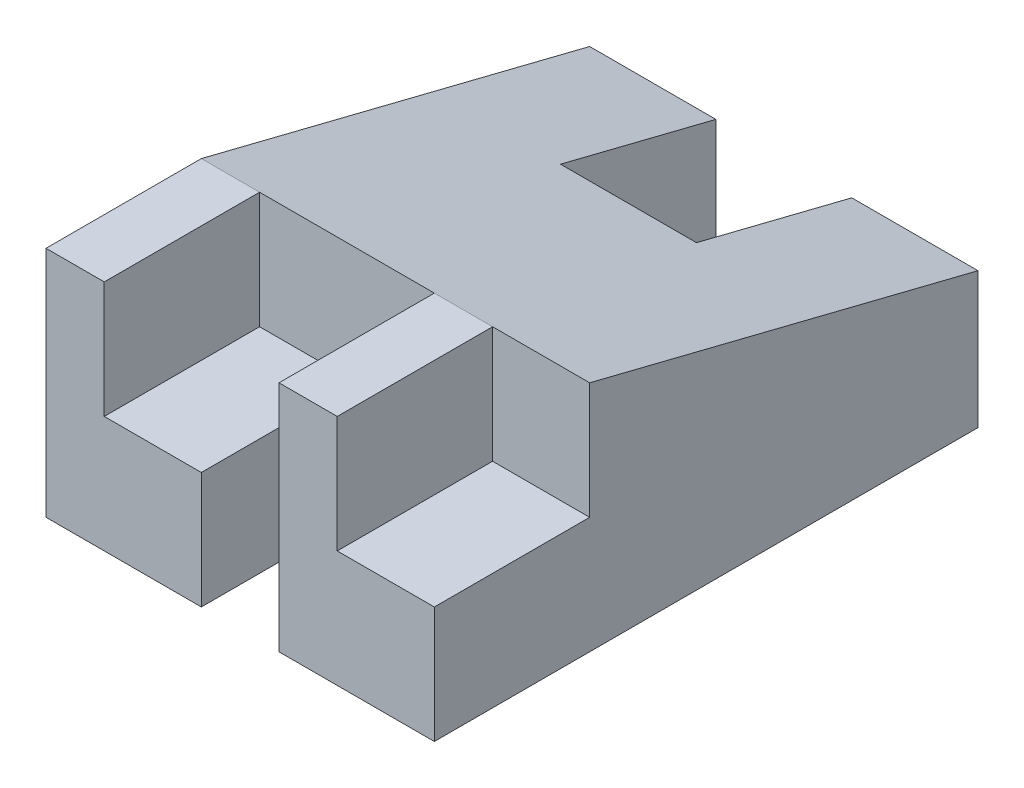
ISO-10303-21;
HEADER;
FILE_DESCRIPTION(('STEP AP214'),'2;1');
FILE_NAME('part.step','',(''),(''),'','','');
FILE_SCHEMA(('AUTOMOTIVE_DESIGN { 1 0 10303 214 1 1 1 1 }'));
ENDSEC;
DATA;
#1=APPLICATION_CONTEXT('core data for automotive mechanical design processes');
#2=APPLICATION_PROTOCOL_DEFINITION('international standard','automotive_design',2000,#1);
#3=PRODUCT_CONTEXT('',#1,'mechanical');
#4=PRODUCT('Part','Part','',(#3));
#5=PRODUCT_RELATED_PRODUCT_CATEGORY('part','',(#4));
#6=PRODUCT_DEFINITION_FORMATION('','',#4);
#7=PRODUCT_DEFINITION_CONTEXT('part definition',#1,'design');
#8=PRODUCT_DEFINITION('design','',#6,#7);
#9=PRODUCT_DEFINITION_SHAPE('','',#8);
#10=(LENGTH_UNIT() NAMED_UNIT(*) SI_UNIT(.MILLI.,.METRE.));
#11=(NAMED_UNIT(*) PLANE_ANGLE_UNIT() SI_UNIT($,.RADIAN.));
#12=(NAMED_UNIT(*) SI_UNIT($,.STERADIAN.) SOLID_ANGLE_UNIT());
#13=UNCERTAINTY_MEASURE_WITH_UNIT(LENGTH_MEASURE(1.E-05),#10,'distance_accuracy_value','');
#14=(GEOMETRIC_REPRESENTATION_CONTEXT(3) GLOBAL_UNCERTAINTY_ASSIGNED_CONTEXT((#13)) GLOBAL_UNIT_ASSIGNED_CONTEXT((#10,
#11,#12)) REPRESENTATION_CONTEXT('',''));
#15=CARTESIAN_POINT('',(0.,0.,0.));
#16=DIRECTION('',(0.,0.,1.));
#17=DIRECTION('',(1.,0.,0.));
#18=AXIS2_PLACEMENT_3D('',#15,#16,#17);
#19=CARTESIAN_POINT('',(31.75,-26.4278044871795,-36.8991987179487));
#20=DIRECTION('',(0.,0.,1.));
#21=DIRECTION('',(1.,0.,0.));
#22=AXIS2_PLACEMENT_3D('',#19,#20,#21);
#23=PLANE('',#22);
#24=DIRECTION('',(-1.,0.,0.));
#25=VECTOR('',#24,1.);
#26=CARTESIAN_POINT('',(31.75,-26.4278044871795,-36.8991987179487));
#27=LINE('',#26,#25);
#28=CARTESIAN_POINT('',(31.75,-26.4278044871795,-36.8991987179487));
#29=VERTEX_POINT('',#28);
#30=CARTESIAN_POINT('',(11.1125,-26.4278044871795,-36.8991987179487));
#31=VERTEX_POINT('',#30);
#32=EDGE_CURVE('E281',#29,#31,#27,.T.);
#33=ORIENTED_EDGE('',*,*,#32,.T.);
#34=DIRECTION('',(0.,-1.,0.));
#35=VECTOR('',#34,1.);
#36=CARTESIAN_POINT('',(11.1125,11.6721955128205,-36.8991987179487));
#37=LINE('',#36,#35);
#38=CARTESIAN_POINT('',(11.1125,-4.20280448717949,-36.8991987179487));
#39=VERTEX_POINT('',#38);
#40=EDGE_CURVE('E169',#39,#31,#37,.T.);
#41=ORIENTED_EDGE('',*,*,#40,.F.);
#42=DIRECTION('',(-1.,0.,0.));
#43=VECTOR('',#42,1.);
#44=CARTESIAN_POINT('',(31.75,-4.20280448717948,-36.8991987179487));
#45=LINE('',#44,#43);
#46=CARTESIAN_POINT('',(31.75,-4.20280448717948,-36.8991987179487));
#47=VERTEX_POINT('',#46);
#48=EDGE_CURVE('E277',#47,#39,#45,.T.);
#49=ORIENTED_EDGE('',*,*,#48,.F.);
#50=DIRECTION('',(0.,1.,0.));
#51=VECTOR('',#50,1.);
#52=CARTESIAN_POINT('',(31.75,-26.4278044871795,-36.8991987179487));
#53=LINE('',#52,#51);
#54=EDGE_CURVE('E249',#29,#47,#53,.T.);
#55=ORIENTED_EDGE('',*,*,#54,.F.);
#56=EDGE_LOOP('',(#33,#41,#49,#55));
#57=FACE_BOUND('',#56,.T.);
#58=ADVANCED_FACE('F33',(#57),#23,.F.);
#59=CARTESIAN_POINT('',(-6.35,-51.8278044871795,52.0008012820513));
#60=DIRECTION('',(-1.,0.,0.));
#61=DIRECTION('',(0.,0.,1.));
#62=AXIS2_PLACEMENT_3D('',#59,#60,#61);
#63=PLANE('',#62);
#64=DIRECTION('',(0.,0.,-1.));
#65=VECTOR('',#64,1.);
#66=CARTESIAN_POINT('',(-6.35,-7.37780448717948,52.0008012820513));
#67=LINE('',#66,#65);
#68=CARTESIAN_POINT('',(-6.35,-7.37780448717948,52.0008012820513));
#69=VERTEX_POINT('',#68);
#70=CARTESIAN_POINT('',(-6.35,-7.37780448717948,26.6008012820513));
#71=VERTEX_POINT('',#70);
#72=EDGE_CURVE('E56',#69,#71,#67,.T.);
#73=ORIENTED_EDGE('',*,*,#72,.F.);
#74=DIRECTION('',(0.,1.,0.));
#75=VECTOR('',#74,1.);
#76=CARTESIAN_POINT('',(-6.35,-51.8278044871795,52.0008012820513));
#77=LINE('',#76,#75);
#78=CARTESIAN_POINT('',(-6.35,-26.4278044871795,52.0008012820513));
#79=VERTEX_POINT('',#78);
#80=EDGE_CURVE('E222',#79,#69,#77,.T.);
#81=ORIENTED_EDGE('',*,*,#80,.F.);
#82=DIRECTION('',(0.,0.,1.));
#83=VECTOR('',#82,1.);
#84=CARTESIAN_POINT('',(-6.35,-26.4278044871795,52.0008012820513));
#85=LINE('',#84,#83);
#86=CARTESIAN_POINT('',(-6.35,-26.4278044871795,26.6008012820513));
#87=VERTEX_POINT('',#86);
#88=EDGE_CURVE('E240',#87,#79,#85,.T.);
#89=ORIENTED_EDGE('',*,*,#88,.F.);
#90=DIRECTION('',(0.,1.,0.));
#91=VECTOR('',#90,1.);
#92=CARTESIAN_POINT('',(-6.35,-51.8278044871795,26.6008012820513));
#93=LINE('',#92,#91);
#94=EDGE_CURVE('E223',#87,#71,#93,.T.);
#95=ORIENTED_EDGE('',*,*,#94,.T.);
#96=EDGE_LOOP('',(#73,#81,#89,#95));
#97=FACE_BOUND('',#96,.T.);
#98=ADVANCED_FACE('F341',(#97),#63,.F.);
#99=CARTESIAN_POINT('',(31.75,-26.4278044871795,52.0008012820513));
#100=DIRECTION('',(0.,0.,-1.));
#101=DIRECTION('',(-1.,0.,0.));
#102=AXIS2_PLACEMENT_3D('',#99,#100,#101);
#103=PLANE('',#102);
#104=DIRECTION('',(1.,0.,0.));
#105=VECTOR('',#104,1.);
#106=CARTESIAN_POINT('',(-6.35,-7.37780448717948,52.0008012820513));
#107=LINE('',#106,#105);
#108=CARTESIAN_POINT('',(-22.225,-7.37780448717948,52.0008012820513));
#109=VERTEX_POINT('',#108);
#110=EDGE_CURVE('E191',#109,#69,#107,.T.);
#111=ORIENTED_EDGE('',*,*,#110,.F.);
#112=DIRECTION('',(0.,1.,0.));
#113=VECTOR('',#112,1.);
#114=CARTESIAN_POINT('',(-22.225,-7.37780448717948,52.0008012820513));
#115=LINE('',#114,#113);
#116=CARTESIAN_POINT('',(-22.225,11.6721955128205,52.0008012820513));
#117=VERTEX_POINT('',#116);
#118=EDGE_CURVE('E195',#109,#117,#115,.T.);
#119=ORIENTED_EDGE('',*,*,#118,.T.);
#120=DIRECTION('',(-1.,0.,0.));
#121=VECTOR('',#120,1.);
#122=CARTESIAN_POINT('',(31.75,11.6721955128205,52.0008012820513));
#123=LINE('',#122,#121);
#124=CARTESIAN_POINT('',(-31.75,11.6721955128205,52.0008012820513));
#125=VERTEX_POINT('',#124);
#126=EDGE_CURVE('E254',#117,#125,#123,.T.);
#127=ORIENTED_EDGE('',*,*,#126,.T.);
#128=DIRECTION('',(0.,-1.,0.));
#129=VECTOR('',#128,1.);
#130=CARTESIAN_POINT('',(-31.75,-26.4278044871795,52.0008012820513));
#131=LINE('',#130,#129);
#132=CARTESIAN_POINT('',(-31.75,-26.4278044871795,52.0008012820513));
#133=VERTEX_POINT('',#132);
#134=EDGE_CURVE('E243',#125,#133,#131,.T.);
#135=ORIENTED_EDGE('',*,*,#134,.T.);
#136=DIRECTION('',(-1.,0.,0.));
#137=VECTOR('',#136,1.);
#138=CARTESIAN_POINT('',(31.75,-26.4278044871795,52.0008012820513));
#139=LINE('',#138,#137);
#140=EDGE_CURVE('E283',#79,#133,#139,.T.);
#141=ORIENTED_EDGE('',*,*,#140,.F.);
#142=ORIENTED_EDGE('',*,*,#80,.T.);
#143=EDGE_LOOP('',(#111,#119,#127,#135,#141,#142));
#144=FACE_BOUND('',#143,.T.);
#145=ADVANCED_FACE('F346',(#144),#103,.F.);
#146=CARTESIAN_POINT('',(31.75,11.6721955128205,26.6008012820513));
#147=DIRECTION('',(0.,-1.,0.));
#148=DIRECTION('',(0.,0.,-1.));
#149=AXIS2_PLACEMENT_3D('',#146,#147,#148);
#150=PLANE('',#149);
#151=ORIENTED_EDGE('',*,*,#126,.F.);
#152=DIRECTION('',(0.,0.,1.));
#153=VECTOR('',#152,1.);
#154=CARTESIAN_POINT('',(-22.225,11.6721955128205,52.0008012820513));
#155=LINE('',#154,#153);
#156=CARTESIAN_POINT('',(-22.225,11.6721955128205,26.6008012820513));
#157=VERTEX_POINT('',#156);
#158=EDGE_CURVE('E180',#157,#117,#155,.T.);
#159=ORIENTED_EDGE('',*,*,#158,.F.);
#160=DIRECTION('',(-1.,0.,0.));
#161=VECTOR('',#160,1.);
#162=CARTESIAN_POINT('',(31.75,11.6721955128205,26.6008012820513));
#163=LINE('',#162,#161);
#164=CARTESIAN_POINT('',(-31.75,11.6721955128205,26.6008012820513));
#165=VERTEX_POINT('',#164);
#166=EDGE_CURVE('E270',#157,#165,#163,.T.);
#167=ORIENTED_EDGE('',*,*,#166,.T.);
#168=DIRECTION('',(0.,0.,1.));
#169=VECTOR('',#168,1.);
#170=CARTESIAN_POINT('',(-31.75,11.6721955128205,26.6008012820513));
#171=LINE('',#170,#169);
#172=EDGE_CURVE('E247',#165,#125,#171,.T.);
#173=ORIENTED_EDGE('',*,*,#172,.T.);
#174=EDGE_LOOP('',(#151,#159,#167,#173));
#175=FACE_BOUND('',#174,.T.);
#176=ADVANCED_FACE('F358',(#175),#150,.F.);
#177=DIRECTION('',(1.,0.,0.));
#178=VECTOR('',#177,1.);
#179=CARTESIAN_POINT('',(31.75,-7.37780448717948,52.0008012820513));
#180=LINE('',#179,#178);
#181=CARTESIAN_POINT('',(15.875,-7.37780448717948,52.0008012820513));
#182=VERTEX_POINT('',#181);
#183=CARTESIAN_POINT('',(31.75,-7.37780448717948,52.0008012820513));
#184=VERTEX_POINT('',#183);
#185=EDGE_CURVE('E209',#182,#184,#180,.T.);
#186=ORIENTED_EDGE('',*,*,#185,.F.);
#187=DIRECTION('',(0.,1.,0.));
#188=VECTOR('',#187,1.);
#189=CARTESIAN_POINT('',(15.875,-7.37780448717948,52.0008012820513));
#190=LINE('',#189,#188);
#191=CARTESIAN_POINT('',(15.875,11.6721955128205,52.0008012820513));
#192=VERTEX_POINT('',#191);
#193=EDGE_CURVE('E213',#182,#192,#190,.T.);
#194=ORIENTED_EDGE('',*,*,#193,.T.);
#195=CARTESIAN_POINT('',(6.35,11.6721955128205,52.0008012820513));
#196=VERTEX_POINT('',#195);
#197=EDGE_CURVE('E268',#192,#196,#123,.T.);
#198=ORIENTED_EDGE('',*,*,#197,.T.);
#199=DIRECTION('',(0.,1.,0.));
#200=VECTOR('',#199,1.);
#201=CARTESIAN_POINT('',(6.35,-51.8278044871795,52.0008012820513));
#202=LINE('',#201,#200);
#203=CARTESIAN_POINT('',(6.35,-26.4278044871795,52.0008012820513));
#204=VERTEX_POINT('',#203);
#205=EDGE_CURVE('E230',#204,#196,#202,.T.);
#206=ORIENTED_EDGE('',*,*,#205,.F.);
#207=CARTESIAN_POINT('',(31.75,-26.4278044871795,52.0008012820513));
#208=VERTEX_POINT('',#207);
#209=EDGE_CURVE('E284',#208,#204,#139,.T.);
#210=ORIENTED_EDGE('',*,*,#209,.F.);
#211=DIRECTION('',(0.,-1.,0.));
#212=VECTOR('',#211,1.);
#213=CARTESIAN_POINT('',(31.75,-26.4278044871795,52.0008012820513));
#214=LINE('',#213,#212);
#215=EDGE_CURVE('E244',#184,#208,#214,.T.);
#216=ORIENTED_EDGE('',*,*,#215,.F.);
#217=EDGE_LOOP('',(#186,#194,#198,#206,#210,#216));
#218=FACE_BOUND('',#217,.T.);
#219=ADVANCED_FACE('F35',(#218),#103,.F.);
#220=CARTESIAN_POINT('',(31.75,-26.4278044871795,52.0008012820513));
#221=DIRECTION('',(0.,1.,0.));
#222=DIRECTION('',(0.,0.,1.));
#223=AXIS2_PLACEMENT_3D('',#220,#221,#222);
#224=PLANE('',#223);
#225=DIRECTION('',(-1.,0.,0.));
#226=VECTOR('',#225,1.);
#227=CARTESIAN_POINT('',(11.1125,-26.4278044871795,-11.4991987179487));
#228=LINE('',#227,#226);
#229=CARTESIAN_POINT('',(11.1125,-26.4278044871795,-11.4991987179487));
#230=VERTEX_POINT('',#229);
#231=CARTESIAN_POINT('',(-11.1125,-26.4278044871795,-11.4991987179487));
#232=VERTEX_POINT('',#231);
#233=EDGE_CURVE('E158',#230,#232,#228,.T.);
#234=ORIENTED_EDGE('',*,*,#233,.F.);
#235=DIRECTION('',(0.,0.,1.));
#236=VECTOR('',#235,1.);
#237=CARTESIAN_POINT('',(11.1125,-26.4278044871795,-36.8991987179487));
#238=LINE('',#237,#236);
#239=EDGE_CURVE('E166',#31,#230,#238,.T.);
#240=ORIENTED_EDGE('',*,*,#239,.F.);
#241=ORIENTED_EDGE('',*,*,#32,.F.);
#242=DIRECTION('',(0.,0.,-1.));
#243=VECTOR('',#242,1.);
#244=CARTESIAN_POINT('',(31.75,-26.4278044871795,52.0008012820513));
#245=LINE('',#244,#243);
#246=EDGE_CURVE('E246',#208,#29,#245,.T.);
#247=ORIENTED_EDGE('',*,*,#246,.F.);
#248=ORIENTED_EDGE('',*,*,#209,.T.);
#249=DIRECTION('',(0.,0.,-1.));
#250=VECTOR('',#249,1.);
#251=CARTESIAN_POINT('',(6.35,-26.4278044871795,52.0008012820513));
#252=LINE('',#251,#250);
#253=CARTESIAN_POINT('',(6.35,-26.4278044871795,26.6008012820513));
#254=VERTEX_POINT('',#253);
#255=EDGE_CURVE('E226',#204,#254,#252,.T.);
#256=ORIENTED_EDGE('',*,*,#255,.T.);
#257=DIRECTION('',(-1.,0.,0.));
#258=VECTOR('',#257,1.);
#259=CARTESIAN_POINT('',(31.75,-26.4278044871795,26.6008012820513));
#260=LINE('',#259,#258);
#261=EDGE_CURVE('E237',#254,#87,#260,.T.);
#262=ORIENTED_EDGE('',*,*,#261,.T.);
#263=ORIENTED_EDGE('',*,*,#88,.T.);
#264=ORIENTED_EDGE('',*,*,#140,.T.);
#265=DIRECTION('',(0.,0.,-1.));
#266=VECTOR('',#265,1.);
#267=CARTESIAN_POINT('',(-31.75,-26.4278044871795,52.0008012820513));
#268=LINE('',#267,#266);
#269=CARTESIAN_POINT('',(-31.75,-26.4278044871795,-36.8991987179487));
#270=VERTEX_POINT('',#269);
#271=EDGE_CURVE('E257',#133,#270,#268,.T.);
#272=ORIENTED_EDGE('',*,*,#271,.T.);
#273=CARTESIAN_POINT('',(-11.1125,-26.4278044871795,-36.8991987179487));
#274=VERTEX_POINT('',#273);
#275=EDGE_CURVE('E280',#274,#270,#27,.T.);
#276=ORIENTED_EDGE('',*,*,#275,.F.);
#277=DIRECTION('',(0.,0.,-1.));
#278=VECTOR('',#277,1.);
#279=CARTESIAN_POINT('',(-11.1125,-26.4278044871795,-36.8991987179487));
#280=LINE('',#279,#278);
#281=EDGE_CURVE('E163',#232,#274,#280,.T.);
#282=ORIENTED_EDGE('',*,*,#281,.F.);
#283=EDGE_LOOP('',(#234,#240,#241,#247,#248,#256,#262,#263,#264,#272,#276,#282));
#284=FACE_BOUND('',#283,.T.);
#285=ADVANCED_FACE('F174',(#284),#224,.F.);
#286=CARTESIAN_POINT('',(-11.1125,-4.20280448717949,-36.8991987179487));
#287=VERTEX_POINT('',#286);
#288=CARTESIAN_POINT('',(-31.75,-4.20280448717948,-36.8991987179487));
#289=VERTEX_POINT('',#288);
#290=EDGE_CURVE('E274',#287,#289,#45,.T.);
#291=ORIENTED_EDGE('',*,*,#290,.F.);
#292=DIRECTION('',(0.,-1.,0.));
#293=VECTOR('',#292,1.);
#294=CARTESIAN_POINT('',(-11.1125,11.6721955128205,-36.8991987179487));
#295=LINE('',#294,#293);
#296=EDGE_CURVE('E181',#287,#274,#295,.T.);
#297=ORIENTED_EDGE('',*,*,#296,.T.);
#298=ORIENTED_EDGE('',*,*,#275,.T.);
#299=DIRECTION('',(0.,1.,0.));
#300=VECTOR('',#299,1.);
#301=CARTESIAN_POINT('',(-31.75,-26.4278044871795,-36.8991987179487));
#302=LINE('',#301,#300);
#303=EDGE_CURVE('E260',#270,#289,#302,.T.);
#304=ORIENTED_EDGE('',*,*,#303,.T.);
#305=EDGE_LOOP('',(#291,#297,#298,#304));
#306=FACE_BOUND('',#305,.T.);
#307=ADVANCED_FACE('F293',(#306),#23,.F.);
#308=CARTESIAN_POINT('',(31.75,-4.20280448717948,-36.8991987179487));
#309=DIRECTION('',(0.,-0.970142500145332,0.242535625036333));
#310=DIRECTION('',(0.,-0.242535625036333,-0.970142500145332));
#311=AXIS2_PLACEMENT_3D('',#308,#309,#310);
#312=PLANE('',#311);
#313=ORIENTED_EDGE('',*,*,#48,.T.);
#314=DIRECTION('',(0.,0.242535625036333,0.970142500145332));
#315=VECTOR('',#314,1.);
#316=CARTESIAN_POINT('',(11.1125,-4.20280448717948,-36.8991987179487));
#317=LINE('',#316,#315);
#318=CARTESIAN_POINT('',(11.1125,2.14719551282052,-11.4991987179487));
#319=VERTEX_POINT('',#318);
#320=EDGE_CURVE('E11',#39,#319,#317,.T.);
#321=ORIENTED_EDGE('',*,*,#320,.T.);
#322=DIRECTION('',(-1.,0.,0.));
#323=VECTOR('',#322,1.);
#324=CARTESIAN_POINT('',(31.75,2.14719551282052,-11.4991987179487));
#325=LINE('',#324,#323);
#326=CARTESIAN_POINT('',(-11.1125,2.14719551282052,-11.4991987179487));
#327=VERTEX_POINT('',#326);
#328=EDGE_CURVE('E161',#319,#327,#325,.T.);
#329=ORIENTED_EDGE('',*,*,#328,.T.);
#330=DIRECTION('',(0.,-0.242535625036333,-0.970142500145332));
#331=VECTOR('',#330,1.);
#332=CARTESIAN_POINT('',(-11.1125,-4.20280448717949,-36.8991987179487));
#333=LINE('',#332,#331);
#334=EDGE_CURVE('E41',#327,#287,#333,.T.);
#335=ORIENTED_EDGE('',*,*,#334,.T.);
#336=ORIENTED_EDGE('',*,*,#290,.T.);
#337=DIRECTION('',(0.,0.242535625036333,0.970142500145332));
#338=VECTOR('',#337,1.);
#339=CARTESIAN_POINT('',(-31.75,-4.20280448717948,-36.8991987179487));
#340=LINE('',#339,#338);
#341=EDGE_CURVE('E263',#289,#165,#340,.T.);
#342=ORIENTED_EDGE('',*,*,#341,.T.);
#343=ORIENTED_EDGE('',*,*,#166,.F.);
#344=CARTESIAN_POINT('',(6.35,11.6721955128205,26.6008012820513));
#345=VERTEX_POINT('',#344);
#346=EDGE_CURVE('E276',#345,#157,#163,.T.);
#347=ORIENTED_EDGE('',*,*,#346,.F.);
#348=CARTESIAN_POINT('',(15.875,11.6721955128205,26.6008012820513));
#349=VERTEX_POINT('',#348);
#350=EDGE_CURVE('E275',#349,#345,#163,.T.);
#351=ORIENTED_EDGE('',*,*,#350,.F.);
#352=CARTESIAN_POINT('',(31.75,11.6721955128205,26.6008012820513));
#353=VERTEX_POINT('',#352);
#354=EDGE_CURVE('E271',#353,#349,#163,.T.);
#355=ORIENTED_EDGE('',*,*,#354,.F.);
#356=DIRECTION('',(0.,0.242535625036333,0.970142500145332));
#357=VECTOR('',#356,1.);
#358=CARTESIAN_POINT('',(31.75,-4.20280448717948,-36.8991987179487));
#359=LINE('',#358,#357);
#360=EDGE_CURVE('E251',#47,#353,#359,.T.);
#361=ORIENTED_EDGE('',*,*,#360,.F.);
#362=EDGE_LOOP('',(#313,#321,#329,#335,#336,#342,#343,#347,#351,#355,#361));
#363=FACE_BOUND('',#362,.T.);
#364=ADVANCED_FACE('F290',(#363),#312,.F.);
#365=ORIENTED_EDGE('',*,*,#197,.F.);
#366=DIRECTION('',(0.,0.,1.));
#367=VECTOR('',#366,1.);
#368=CARTESIAN_POINT('',(15.875,11.6721955128205,26.6008012820513));
#369=LINE('',#368,#367);
#370=EDGE_CURVE('E198',#349,#192,#369,.T.);
#371=ORIENTED_EDGE('',*,*,#370,.F.);
#372=ORIENTED_EDGE('',*,*,#350,.T.);
#373=DIRECTION('',(0.,0.,-1.));
#374=VECTOR('',#373,1.);
#375=CARTESIAN_POINT('',(6.35,11.6721955128205,52.0008012820513));
#376=LINE('',#375,#374);
#377=EDGE_CURVE('E216',#196,#345,#376,.T.);
#378=ORIENTED_EDGE('',*,*,#377,.F.);
#379=EDGE_LOOP('',(#365,#371,#372,#378));
#380=FACE_BOUND('',#379,.T.);
#381=ADVANCED_FACE('F311',(#380),#150,.F.);
#382=CARTESIAN_POINT('',(31.75,0.,0.));
#383=DIRECTION('',(1.,0.,0.));
#384=DIRECTION('',(0.,0.,-1.));
#385=AXIS2_PLACEMENT_3D('',#382,#383,#384);
#386=PLANE('',#385);
#387=DIRECTION('',(0.,1.,0.));
#388=VECTOR('',#387,1.);
#389=CARTESIAN_POINT('',(31.75,-7.37780448717948,26.6008012820513));
#390=LINE('',#389,#388);
#391=CARTESIAN_POINT('',(31.75,-7.37780448717948,26.6008012820513));
#392=VERTEX_POINT('',#391);
#393=EDGE_CURVE('E211',#392,#353,#390,.T.);
#394=ORIENTED_EDGE('',*,*,#393,.F.);
#395=DIRECTION('',(0.,0.,-1.));
#396=VECTOR('',#395,1.);
#397=CARTESIAN_POINT('',(31.75,-7.37780448717948,26.6008012820513));
#398=LINE('',#397,#396);
#399=EDGE_CURVE('E200',#184,#392,#398,.T.);
#400=ORIENTED_EDGE('',*,*,#399,.F.);
#401=ORIENTED_EDGE('',*,*,#215,.T.);
#402=ORIENTED_EDGE('',*,*,#246,.T.);
#403=ORIENTED_EDGE('',*,*,#54,.T.);
#404=ORIENTED_EDGE('',*,*,#360,.T.);
#405=EDGE_LOOP('',(#394,#400,#401,#402,#403,#404));
#406=FACE_BOUND('',#405,.T.);
#407=ADVANCED_FACE('F328',(#406),#386,.T.);
#408=CARTESIAN_POINT('',(-31.75,0.,0.));
#409=DIRECTION('',(1.,0.,0.));
#410=DIRECTION('',(0.,0.,-1.));
#411=AXIS2_PLACEMENT_3D('',#408,#409,#410);
#412=PLANE('',#411);
#413=ORIENTED_EDGE('',*,*,#134,.F.);
#414=ORIENTED_EDGE('',*,*,#172,.F.);
#415=ORIENTED_EDGE('',*,*,#341,.F.);
#416=ORIENTED_EDGE('',*,*,#303,.F.);
#417=ORIENTED_EDGE('',*,*,#271,.F.);
#418=EDGE_LOOP('',(#413,#414,#415,#416,#417));
#419=FACE_BOUND('',#418,.T.);
#420=ADVANCED_FACE('F300',(#419),#412,.F.);
#421=CARTESIAN_POINT('',(-6.35,-51.8278044871795,26.6008012820513));
#422=DIRECTION('',(0.,0.,-1.));
#423=DIRECTION('',(0.,1.,0.));
#424=AXIS2_PLACEMENT_3D('',#421,#422,#423);
#425=PLANE('',#424);
#426=DIRECTION('',(0.,1.,0.));
#427=VECTOR('',#426,1.);
#428=CARTESIAN_POINT('',(6.35,-51.8278044871795,26.6008012820513));
#429=LINE('',#428,#427);
#430=EDGE_CURVE('E227',#254,#345,#429,.T.);
#431=ORIENTED_EDGE('',*,*,#430,.T.);
#432=ORIENTED_EDGE('',*,*,#346,.T.);
#433=DIRECTION('',(0.,1.,0.));
#434=VECTOR('',#433,1.);
#435=CARTESIAN_POINT('',(-22.225,-7.37780448717948,26.6008012820513));
#436=LINE('',#435,#434);
#437=CARTESIAN_POINT('',(-22.225,-7.37780448717948,26.6008012820513));
#438=VERTEX_POINT('',#437);
#439=EDGE_CURVE('E193',#438,#157,#436,.T.);
#440=ORIENTED_EDGE('',*,*,#439,.F.);
#441=DIRECTION('',(-1.,0.,0.));
#442=VECTOR('',#441,1.);
#443=CARTESIAN_POINT('',(-6.35,-7.37780448717948,26.6008012820513));
#444=LINE('',#443,#442);
#445=EDGE_CURVE('E186',#71,#438,#444,.T.);
#446=ORIENTED_EDGE('',*,*,#445,.F.);
#447=ORIENTED_EDGE('',*,*,#94,.F.);
#448=ORIENTED_EDGE('',*,*,#261,.F.);
#449=EDGE_LOOP('',(#431,#432,#440,#446,#447,#448));
#450=FACE_BOUND('',#449,.T.);
#451=ADVANCED_FACE('F315',(#450),#425,.F.);
#452=CARTESIAN_POINT('',(6.35,-51.8278044871795,52.0008012820513));
#453=DIRECTION('',(1.,0.,0.));
#454=DIRECTION('',(0.,0.,-1.));
#455=AXIS2_PLACEMENT_3D('',#452,#453,#454);
#456=PLANE('',#455);
#457=ORIENTED_EDGE('',*,*,#205,.T.);
#458=ORIENTED_EDGE('',*,*,#377,.T.);
#459=ORIENTED_EDGE('',*,*,#430,.F.);
#460=ORIENTED_EDGE('',*,*,#255,.F.);
#461=EDGE_LOOP('',(#457,#458,#459,#460));
#462=FACE_BOUND('',#461,.T.);
#463=ADVANCED_FACE('F318',(#462),#456,.F.);
#464=CARTESIAN_POINT('',(15.875,-7.37780448717948,26.6008012820513));
#465=DIRECTION('',(-1.,0.,0.));
#466=DIRECTION('',(0.,0.,1.));
#467=AXIS2_PLACEMENT_3D('',#464,#465,#466);
#468=PLANE('',#467);
#469=ORIENTED_EDGE('',*,*,#370,.T.);
#470=ORIENTED_EDGE('',*,*,#193,.F.);
#471=DIRECTION('',(0.,0.,1.));
#472=VECTOR('',#471,1.);
#473=CARTESIAN_POINT('',(15.875,-7.37780448717948,26.6008012820513));
#474=LINE('',#473,#472);
#475=CARTESIAN_POINT('',(15.875,-7.37780448717948,26.6008012820513));
#476=VERTEX_POINT('',#475);
#477=EDGE_CURVE('E206',#476,#182,#474,.T.);
#478=ORIENTED_EDGE('',*,*,#477,.F.);
#479=DIRECTION('',(0.,1.,0.));
#480=VECTOR('',#479,1.);
#481=CARTESIAN_POINT('',(15.875,-7.37780448717948,26.6008012820513));
#482=LINE('',#481,#480);
#483=EDGE_CURVE('E217',#476,#349,#482,.T.);
#484=ORIENTED_EDGE('',*,*,#483,.T.);
#485=EDGE_LOOP('',(#469,#470,#478,#484));
#486=FACE_BOUND('',#485,.T.);
#487=ADVANCED_FACE('F335',(#486),#468,.F.);
#488=CARTESIAN_POINT('',(31.75,-7.37780448717948,26.6008012820513));
#489=DIRECTION('',(0.,0.,-1.));
#490=DIRECTION('',(-1.,0.,0.));
#491=AXIS2_PLACEMENT_3D('',#488,#489,#490);
#492=PLANE('',#491);
#493=ORIENTED_EDGE('',*,*,#354,.T.);
#494=ORIENTED_EDGE('',*,*,#483,.F.);
#495=DIRECTION('',(-1.,0.,0.));
#496=VECTOR('',#495,1.);
#497=CARTESIAN_POINT('',(31.75,-7.37780448717948,26.6008012820513));
#498=LINE('',#497,#496);
#499=EDGE_CURVE('E203',#392,#476,#498,.T.);
#500=ORIENTED_EDGE('',*,*,#499,.F.);
#501=ORIENTED_EDGE('',*,*,#393,.T.);
#502=EDGE_LOOP('',(#493,#494,#500,#501));
#503=FACE_BOUND('',#502,.T.);
#504=ADVANCED_FACE('F337',(#503),#492,.F.);
#505=CARTESIAN_POINT('',(0.,-7.37780448717947,0.));
#506=DIRECTION('',(0.,-1.,0.));
#507=DIRECTION('',(0.,0.,-1.));
#508=AXIS2_PLACEMENT_3D('',#505,#506,#507);
#509=PLANE('',#508);
#510=ORIENTED_EDGE('',*,*,#399,.T.);
#511=ORIENTED_EDGE('',*,*,#499,.T.);
#512=ORIENTED_EDGE('',*,*,#477,.T.);
#513=ORIENTED_EDGE('',*,*,#185,.T.);
#514=EDGE_LOOP('',(#510,#511,#512,#513));
#515=FACE_BOUND('',#514,.T.);
#516=ADVANCED_FACE('F332',(#515),#509,.F.);
#517=CARTESIAN_POINT('',(-22.225,-7.37780448717948,52.0008012820513));
#518=DIRECTION('',(-1.,0.,0.));
#519=DIRECTION('',(0.,0.,1.));
#520=AXIS2_PLACEMENT_3D('',#517,#518,#519);
#521=PLANE('',#520);
#522=ORIENTED_EDGE('',*,*,#158,.T.);
#523=ORIENTED_EDGE('',*,*,#118,.F.);
#524=DIRECTION('',(0.,0.,1.));
#525=VECTOR('',#524,1.);
#526=CARTESIAN_POINT('',(-22.225,-7.37780448717948,52.0008012820513));
#527=LINE('',#526,#525);
#528=EDGE_CURVE('E188',#438,#109,#527,.T.);
#529=ORIENTED_EDGE('',*,*,#528,.F.);
#530=ORIENTED_EDGE('',*,*,#439,.T.);
#531=EDGE_LOOP('',(#522,#523,#529,#530));
#532=FACE_BOUND('',#531,.T.);
#533=ADVANCED_FACE('F373',(#532),#521,.F.);
#534=CARTESIAN_POINT('',(0.,-7.37780448717947,0.));
#535=DIRECTION('',(0.,1.,0.));
#536=DIRECTION('',(0.,0.,1.));
#537=AXIS2_PLACEMENT_3D('',#534,#535,#536);
#538=PLANE('',#537);
#539=ORIENTED_EDGE('',*,*,#72,.T.);
#540=ORIENTED_EDGE('',*,*,#445,.T.);
#541=ORIENTED_EDGE('',*,*,#528,.T.);
#542=ORIENTED_EDGE('',*,*,#110,.T.);
#543=EDGE_LOOP('',(#539,#540,#541,#542));
#544=FACE_BOUND('',#543,.T.);
#545=ADVANCED_FACE('F370',(#544),#538,.T.);
#546=CARTESIAN_POINT('',(11.1125,11.6721955128205,-36.8991987179487));
#547=DIRECTION('',(1.,0.,0.));
#548=DIRECTION('',(0.,0.,-1.));
#549=AXIS2_PLACEMENT_3D('',#546,#547,#548);
#550=PLANE('',#549);
#551=ORIENTED_EDGE('',*,*,#40,.T.);
#552=ORIENTED_EDGE('',*,*,#239,.T.);
#553=DIRECTION('',(0.,-1.,0.));
#554=VECTOR('',#553,1.);
#555=CARTESIAN_POINT('',(11.1125,11.6721955128205,-11.4991987179487));
#556=LINE('',#555,#554);
#557=EDGE_CURVE('E154',#319,#230,#556,.T.);
#558=ORIENTED_EDGE('',*,*,#557,.F.);
#559=ORIENTED_EDGE('',*,*,#320,.F.);
#560=EDGE_LOOP('',(#551,#552,#558,#559));
#561=FACE_BOUND('',#560,.T.);
#562=ADVANCED_FACE('F167',(#561),#550,.F.);
#563=CARTESIAN_POINT('',(-11.1125,11.6721955128205,-36.8991987179487));
#564=DIRECTION('',(-1.,0.,0.));
#565=DIRECTION('',(0.,0.,1.));
#566=AXIS2_PLACEMENT_3D('',#563,#564,#565);
#567=PLANE('',#566);
#568=DIRECTION('',(0.,-1.,0.));
#569=VECTOR('',#568,1.);
#570=CARTESIAN_POINT('',(-11.1125,11.6721955128205,-11.4991987179487));
#571=LINE('',#570,#569);
#572=EDGE_CURVE('E48',#327,#232,#571,.T.);
#573=ORIENTED_EDGE('',*,*,#572,.T.);
#574=ORIENTED_EDGE('',*,*,#281,.T.);
#575=ORIENTED_EDGE('',*,*,#296,.F.);
#576=ORIENTED_EDGE('',*,*,#334,.F.);
#577=EDGE_LOOP('',(#573,#574,#575,#576));
#578=FACE_BOUND('',#577,.T.);
#579=ADVANCED_FACE('F465',(#578),#567,.F.);
#580=CARTESIAN_POINT('',(11.1125,11.6721955128205,-11.4991987179487));
#581=DIRECTION('',(0.,0.,1.));
#582=DIRECTION('',(1.,0.,0.));
#583=AXIS2_PLACEMENT_3D('',#580,#581,#582);
#584=PLANE('',#583);
#585=ORIENTED_EDGE('',*,*,#557,.T.);
#586=ORIENTED_EDGE('',*,*,#233,.T.);
#587=ORIENTED_EDGE('',*,*,#572,.F.);
#588=ORIENTED_EDGE('',*,*,#328,.F.);
#589=EDGE_LOOP('',(#585,#586,#587,#588));
#590=FACE_BOUND('',#589,.T.);
#591=ADVANCED_FACE('F156',(#590),#584,.F.);
#592=CLOSED_SHELL('',(#58,#98,#145,#176,#219,#285,#307,#364,#381,#407,#420,#451,#463,#487,#504,
#516,#533,#545,#562,#579,#591));
#593=MANIFOLD_SOLID_BREP('B2',#592);
#594=ADVANCED_BREP_SHAPE_REPRESENTATION('',(#18,#593),#14);
#595=SHAPE_DEFINITION_REPRESENTATION(#9,#594);
ENDSEC;
END-ISO-10303-21;
